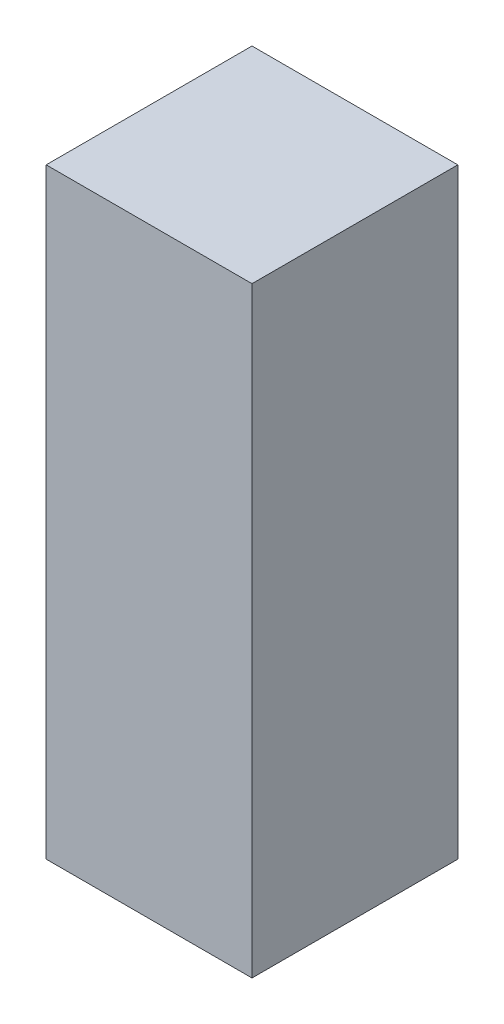
ISO-10303-21;
HEADER;
FILE_DESCRIPTION(('STEP AP214'),'2;1');
FILE_NAME('part.step','',(''),(''),'','','');
FILE_SCHEMA(('AUTOMOTIVE_DESIGN { 1 0 10303 214 1 1 1 1 }'));
ENDSEC;
DATA;
#1=APPLICATION_CONTEXT('core data for automotive mechanical design processes');
#2=APPLICATION_PROTOCOL_DEFINITION('international standard','automotive_design',2000,#1);
#3=PRODUCT_CONTEXT('',#1,'mechanical');
#4=PRODUCT('Part','Part','',(#3));
#5=PRODUCT_RELATED_PRODUCT_CATEGORY('part','',(#4));
#6=PRODUCT_DEFINITION_FORMATION('','',#4);
#7=PRODUCT_DEFINITION_CONTEXT('part definition',#1,'design');
#8=PRODUCT_DEFINITION('design','',#6,#7);
#9=PRODUCT_DEFINITION_SHAPE('','',#8);
#10=(LENGTH_UNIT() NAMED_UNIT(*) SI_UNIT(.MILLI.,.METRE.));
#11=(NAMED_UNIT(*) PLANE_ANGLE_UNIT() SI_UNIT($,.RADIAN.));
#12=(NAMED_UNIT(*) SI_UNIT($,.STERADIAN.) SOLID_ANGLE_UNIT());
#13=UNCERTAINTY_MEASURE_WITH_UNIT(LENGTH_MEASURE(1.E-05),#10,'distance_accuracy_value','');
#14=(GEOMETRIC_REPRESENTATION_CONTEXT(3) GLOBAL_UNCERTAINTY_ASSIGNED_CONTEXT((#13)) GLOBAL_UNIT_ASSIGNED_CONTEXT((#10,
#11,#12)) REPRESENTATION_CONTEXT('',''));
#15=CARTESIAN_POINT('',(0.,0.,0.));
#16=DIRECTION('',(0.,0.,1.));
#17=DIRECTION('',(1.,0.,0.));
#18=AXIS2_PLACEMENT_3D('',#15,#16,#17);
#19=CARTESIAN_POINT('',(0.,74.5,0.));
#20=DIRECTION('',(-0.32383726615946,0.946112797210971,0.));
#21=DIRECTION('',(0.946112797210971,0.32383726615946,0.));
#22=AXIS2_PLACEMENT_3D('',#19,#20,#21);
#23=SPHERICAL_SURFACE('',#22,13.2);
#24=CARTESIAN_POINT('',(-4.27465191330488,86.9886889231848,0.));
#25=VERTEX_POINT('',#24);
#26=VERTEX_LOOP('',#25);
#27=FACE_BOUND('',#26,.T.);
#28=ADVANCED_FACE('F45',(#27),#23,.T.);
#29=CLOSED_SHELL('',(#28));
#30=MANIFOLD_SOLID_BREP('B2',#29);
#31=CARTESIAN_POINT('',(25.5,149.,25.5));
#32=DIRECTION('',(-1.,0.,0.));
#33=DIRECTION('',(0.,0.,1.));
#34=AXIS2_PLACEMENT_3D('',#31,#32,#33);
#35=PLANE('',#34);
#36=DIRECTION('',(0.,0.,-1.));
#37=VECTOR('',#36,1.);
#38=CARTESIAN_POINT('',(25.5,0.,25.5));
#39=LINE('',#38,#37);
#40=CARTESIAN_POINT('',(25.5,0.,25.5));
#41=VERTEX_POINT('',#40);
#42=CARTESIAN_POINT('',(25.5,0.,-25.5));
#43=VERTEX_POINT('',#42);
#44=EDGE_CURVE('E122',#41,#43,#39,.T.);
#45=ORIENTED_EDGE('',*,*,#44,.T.);
#46=DIRECTION('',(0.,-1.,0.));
#47=VECTOR('',#46,1.);
#48=CARTESIAN_POINT('',(25.5,149.,-25.5));
#49=LINE('',#48,#47);
#50=CARTESIAN_POINT('',(25.5,149.,-25.5));
#51=VERTEX_POINT('',#50);
#52=EDGE_CURVE('E43',#51,#43,#49,.T.);
#53=ORIENTED_EDGE('',*,*,#52,.F.);
#54=DIRECTION('',(0.,0.,-1.));
#55=VECTOR('',#54,1.);
#56=CARTESIAN_POINT('',(25.5,149.,25.5));
#57=LINE('',#56,#55);
#58=CARTESIAN_POINT('',(25.5,149.,25.5));
#59=VERTEX_POINT('',#58);
#60=EDGE_CURVE('E110',#59,#51,#57,.T.);
#61=ORIENTED_EDGE('',*,*,#60,.F.);
#62=DIRECTION('',(0.,-1.,0.));
#63=VECTOR('',#62,1.);
#64=CARTESIAN_POINT('',(25.5,149.,25.5));
#65=LINE('',#64,#63);
#66=EDGE_CURVE('E118',#59,#41,#65,.T.);
#67=ORIENTED_EDGE('',*,*,#66,.T.);
#68=EDGE_LOOP('',(#45,#53,#61,#67));
#69=FACE_BOUND('',#68,.T.);
#70=ADVANCED_FACE('F59',(#69),#35,.F.);
#71=CARTESIAN_POINT('',(-25.5,149.,-25.5));
#72=DIRECTION('',(0.,0.,1.));
#73=DIRECTION('',(1.,0.,0.));
#74=AXIS2_PLACEMENT_3D('',#71,#72,#73);
#75=PLANE('',#74);
#76=DIRECTION('',(-1.,0.,0.));
#77=VECTOR('',#76,1.);
#78=CARTESIAN_POINT('',(-25.5,0.,-25.5));
#79=LINE('',#78,#77);
#80=CARTESIAN_POINT('',(-25.5,0.,-25.5));
#81=VERTEX_POINT('',#80);
#82=EDGE_CURVE('E114',#43,#81,#79,.T.);
#83=ORIENTED_EDGE('',*,*,#82,.T.);
#84=DIRECTION('',(0.,-1.,0.));
#85=VECTOR('',#84,1.);
#86=CARTESIAN_POINT('',(-25.5,149.,-25.5));
#87=LINE('',#86,#85);
#88=CARTESIAN_POINT('',(-25.5,149.,-25.5));
#89=VERTEX_POINT('',#88);
#90=EDGE_CURVE('E67',#89,#81,#87,.T.);
#91=ORIENTED_EDGE('',*,*,#90,.F.);
#92=DIRECTION('',(-1.,0.,0.));
#93=VECTOR('',#92,1.);
#94=CARTESIAN_POINT('',(-25.5,149.,-25.5));
#95=LINE('',#94,#93);
#96=EDGE_CURVE('E105',#51,#89,#95,.T.);
#97=ORIENTED_EDGE('',*,*,#96,.F.);
#98=ORIENTED_EDGE('',*,*,#52,.T.);
#99=EDGE_LOOP('',(#83,#91,#97,#98));
#100=FACE_BOUND('',#99,.T.);
#101=ADVANCED_FACE('F113',(#100),#75,.F.);
#102=CARTESIAN_POINT('',(-25.5,149.,25.5));
#103=DIRECTION('',(1.,0.,0.));
#104=DIRECTION('',(0.,0.,-1.));
#105=AXIS2_PLACEMENT_3D('',#102,#103,#104);
#106=PLANE('',#105);
#107=DIRECTION('',(0.,0.,1.));
#108=VECTOR('',#107,1.);
#109=CARTESIAN_POINT('',(-25.5,0.,25.5));
#110=LINE('',#109,#108);
#111=CARTESIAN_POINT('',(-25.5,0.,25.5));
#112=VERTEX_POINT('',#111);
#113=EDGE_CURVE('E92',#81,#112,#110,.T.);
#114=ORIENTED_EDGE('',*,*,#113,.T.);
#115=DIRECTION('',(0.,-1.,0.));
#116=VECTOR('',#115,1.);
#117=CARTESIAN_POINT('',(-25.5,149.,25.5));
#118=LINE('',#117,#116);
#119=CARTESIAN_POINT('',(-25.5,149.,25.5));
#120=VERTEX_POINT('',#119);
#121=EDGE_CURVE('E115',#120,#112,#118,.T.);
#122=ORIENTED_EDGE('',*,*,#121,.F.);
#123=DIRECTION('',(0.,0.,1.));
#124=VECTOR('',#123,1.);
#125=CARTESIAN_POINT('',(-25.5,149.,25.5));
#126=LINE('',#125,#124);
#127=EDGE_CURVE('E108',#89,#120,#126,.T.);
#128=ORIENTED_EDGE('',*,*,#127,.F.);
#129=ORIENTED_EDGE('',*,*,#90,.T.);
#130=EDGE_LOOP('',(#114,#122,#128,#129));
#131=FACE_BOUND('',#130,.T.);
#132=ADVANCED_FACE('F116',(#131),#106,.F.);
#133=CARTESIAN_POINT('',(-25.5,149.,25.5));
#134=DIRECTION('',(0.,0.,-1.));
#135=DIRECTION('',(-1.,0.,0.));
#136=AXIS2_PLACEMENT_3D('',#133,#134,#135);
#137=PLANE('',#136);
#138=DIRECTION('',(1.,0.,0.));
#139=VECTOR('',#138,1.);
#140=CARTESIAN_POINT('',(-25.5,0.,25.5));
#141=LINE('',#140,#139);
#142=EDGE_CURVE('E98',#112,#41,#141,.T.);
#143=ORIENTED_EDGE('',*,*,#142,.T.);
#144=ORIENTED_EDGE('',*,*,#66,.F.);
#145=DIRECTION('',(1.,0.,0.));
#146=VECTOR('',#145,1.);
#147=CARTESIAN_POINT('',(-25.5,149.,25.5));
#148=LINE('',#147,#146);
#149=EDGE_CURVE('E75',#120,#59,#148,.T.);
#150=ORIENTED_EDGE('',*,*,#149,.F.);
#151=ORIENTED_EDGE('',*,*,#121,.T.);
#152=EDGE_LOOP('',(#143,#144,#150,#151));
#153=FACE_BOUND('',#152,.T.);
#154=ADVANCED_FACE('F129',(#153),#137,.F.);
#155=CARTESIAN_POINT('',(0.,149.,0.));
#156=DIRECTION('',(0.,-1.,0.));
#157=DIRECTION('',(0.,0.,-1.));
#158=AXIS2_PLACEMENT_3D('',#155,#156,#157);
#159=PLANE('',#158);
#160=ORIENTED_EDGE('',*,*,#60,.T.);
#161=ORIENTED_EDGE('',*,*,#96,.T.);
#162=ORIENTED_EDGE('',*,*,#127,.T.);
#163=ORIENTED_EDGE('',*,*,#149,.T.);
#164=EDGE_LOOP('',(#160,#161,#162,#163));
#165=FACE_BOUND('',#164,.T.);
#166=ADVANCED_FACE('F106',(#165),#159,.F.);
#167=CARTESIAN_POINT('',(0.,0.,0.));
#168=DIRECTION('',(0.,-1.,0.));
#169=DIRECTION('',(0.,0.,-1.));
#170=AXIS2_PLACEMENT_3D('',#167,#168,#169);
#171=PLANE('',#170);
#172=ORIENTED_EDGE('',*,*,#44,.F.);
#173=ORIENTED_EDGE('',*,*,#142,.F.);
#174=ORIENTED_EDGE('',*,*,#113,.F.);
#175=ORIENTED_EDGE('',*,*,#82,.F.);
#176=EDGE_LOOP('',(#172,#173,#174,#175));
#177=FACE_BOUND('',#176,.T.);
#178=ADVANCED_FACE('F132',(#177),#171,.T.);
#179=CLOSED_SHELL('',(#70,#101,#132,#154,#166,#178));
#180=CARTESIAN_POINT('',(0.,74.5,0.));
#181=DIRECTION('',(-0.32383726615946,0.946112797210971,0.));
#182=DIRECTION('',(0.946112797210971,0.32383726615946,0.));
#183=AXIS2_PLACEMENT_3D('',#180,#181,#182);
#184=SPHERICAL_SURFACE('',#183,13.2);
#185=CARTESIAN_POINT('',(-4.27465191330488,86.9886889231848,0.));
#186=VERTEX_POINT('',#185);
#187=VERTEX_LOOP('',#186);
#188=FACE_BOUND('',#187,.T.);
#189=ADVANCED_FACE('F149',(#188),#184,.F.);
#190=CLOSED_SHELL('',(#189));
#191=ORIENTED_CLOSED_SHELL('',*,#190,.T.);
#192=BREP_WITH_VOIDS('B6',#179,(#191));
#193=ADVANCED_BREP_SHAPE_REPRESENTATION('',(#18,#30,#192),#14);
#194=SHAPE_DEFINITION_REPRESENTATION(#9,#193);
ENDSEC;
END-ISO-10303-21;
